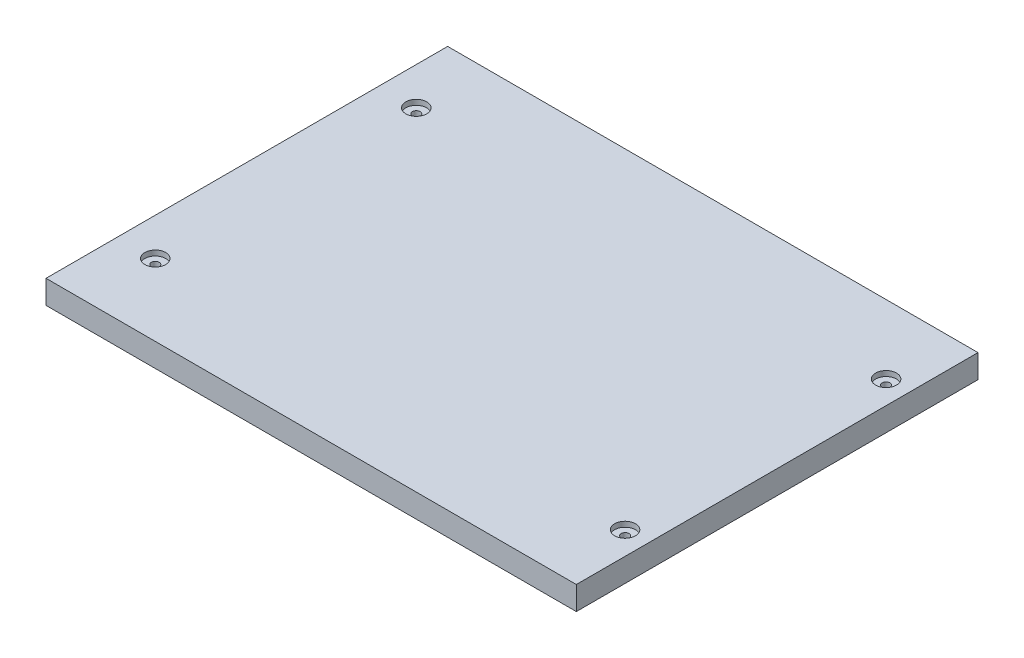
ISO-10303-21;
HEADER;
FILE_DESCRIPTION(('STEP AP214'),'2;1');
FILE_NAME('part.step','',(''),(''),'','','');
FILE_SCHEMA(('AUTOMOTIVE_DESIGN { 1 0 10303 214 1 1 1 1 }'));
ENDSEC;
DATA;
#1=APPLICATION_CONTEXT('core data for automotive mechanical design processes');
#2=APPLICATION_PROTOCOL_DEFINITION('international standard','automotive_design',2000,#1);
#3=PRODUCT_CONTEXT('',#1,'mechanical');
#4=PRODUCT('Part','Part','',(#3));
#5=PRODUCT_RELATED_PRODUCT_CATEGORY('part','',(#4));
#6=PRODUCT_DEFINITION_FORMATION('','',#4);
#7=PRODUCT_DEFINITION_CONTEXT('part definition',#1,'design');
#8=PRODUCT_DEFINITION('design','',#6,#7);
#9=PRODUCT_DEFINITION_SHAPE('','',#8);
#10=(LENGTH_UNIT() NAMED_UNIT(*) SI_UNIT(.MILLI.,.METRE.));
#11=(NAMED_UNIT(*) PLANE_ANGLE_UNIT() SI_UNIT($,.RADIAN.));
#12=(NAMED_UNIT(*) SI_UNIT($,.STERADIAN.) SOLID_ANGLE_UNIT());
#13=UNCERTAINTY_MEASURE_WITH_UNIT(LENGTH_MEASURE(1.E-05),#10,'distance_accuracy_value','');
#14=(GEOMETRIC_REPRESENTATION_CONTEXT(3) GLOBAL_UNCERTAINTY_ASSIGNED_CONTEXT((#13)) GLOBAL_UNIT_ASSIGNED_CONTEXT((#10,
#11,#12)) REPRESENTATION_CONTEXT('',''));
#15=CARTESIAN_POINT('',(0.,0.,0.));
#16=DIRECTION('',(0.,0.,1.));
#17=DIRECTION('',(1.,0.,0.));
#18=AXIS2_PLACEMENT_3D('',#15,#16,#17);
#19=CARTESIAN_POINT('',(0.,18.,0.));
#20=DIRECTION('',(1.,0.,0.));
#21=DIRECTION('',(0.,0.,-1.));
#22=AXIS2_PLACEMENT_3D('',#19,#20,#21);
#23=PLANE('',#22);
#24=DIRECTION('',(0.,0.,1.));
#25=VECTOR('',#24,1.);
#26=CARTESIAN_POINT('',(0.,0.,0.));
#27=LINE('',#26,#25);
#28=CARTESIAN_POINT('',(0.,0.,-307.8));
#29=VERTEX_POINT('',#28);
#30=CARTESIAN_POINT('',(0.,0.,0.));
#31=VERTEX_POINT('',#30);
#32=EDGE_CURVE('E116',#29,#31,#27,.T.);
#33=ORIENTED_EDGE('',*,*,#32,.T.);
#34=DIRECTION('',(0.,-1.,0.));
#35=VECTOR('',#34,1.);
#36=CARTESIAN_POINT('',(0.,18.,0.));
#37=LINE('',#36,#35);
#38=CARTESIAN_POINT('',(0.,18.,0.));
#39=VERTEX_POINT('',#38);
#40=EDGE_CURVE('E11',#39,#31,#37,.T.);
#41=ORIENTED_EDGE('',*,*,#40,.F.);
#42=DIRECTION('',(0.,0.,1.));
#43=VECTOR('',#42,1.);
#44=CARTESIAN_POINT('',(0.,18.,0.));
#45=LINE('',#44,#43);
#46=CARTESIAN_POINT('',(0.,18.,-307.8));
#47=VERTEX_POINT('',#46);
#48=EDGE_CURVE('E99',#47,#39,#45,.T.);
#49=ORIENTED_EDGE('',*,*,#48,.F.);
#50=DIRECTION('',(0.,-1.,0.));
#51=VECTOR('',#50,1.);
#52=CARTESIAN_POINT('',(0.,18.,-307.8));
#53=LINE('',#52,#51);
#54=EDGE_CURVE('E112',#47,#29,#53,.T.);
#55=ORIENTED_EDGE('',*,*,#54,.T.);
#56=EDGE_LOOP('',(#33,#41,#49,#55));
#57=FACE_BOUND('',#56,.T.);
#58=ADVANCED_FACE('F45',(#57),#23,.F.);
#59=CARTESIAN_POINT('',(0.,18.,0.));
#60=DIRECTION('',(0.,0.,-1.));
#61=DIRECTION('',(-1.,0.,0.));
#62=AXIS2_PLACEMENT_3D('',#59,#60,#61);
#63=PLANE('',#62);
#64=DIRECTION('',(1.,0.,0.));
#65=VECTOR('',#64,1.);
#66=CARTESIAN_POINT('',(0.,0.,0.));
#67=LINE('',#66,#65);
#68=CARTESIAN_POINT('',(406.4,0.,0.));
#69=VERTEX_POINT('',#68);
#70=EDGE_CURVE('E104',#31,#69,#67,.T.);
#71=ORIENTED_EDGE('',*,*,#70,.T.);
#72=DIRECTION('',(0.,-1.,0.));
#73=VECTOR('',#72,1.);
#74=CARTESIAN_POINT('',(406.4,18.,0.));
#75=LINE('',#74,#73);
#76=CARTESIAN_POINT('',(406.4,18.,0.));
#77=VERTEX_POINT('',#76);
#78=EDGE_CURVE('E55',#77,#69,#75,.T.);
#79=ORIENTED_EDGE('',*,*,#78,.F.);
#80=DIRECTION('',(1.,0.,0.));
#81=VECTOR('',#80,1.);
#82=CARTESIAN_POINT('',(0.,18.,0.));
#83=LINE('',#82,#81);
#84=EDGE_CURVE('E94',#39,#77,#83,.T.);
#85=ORIENTED_EDGE('',*,*,#84,.F.);
#86=ORIENTED_EDGE('',*,*,#40,.T.);
#87=EDGE_LOOP('',(#71,#79,#85,#86));
#88=FACE_BOUND('',#87,.T.);
#89=ADVANCED_FACE('F103',(#88),#63,.F.);
#90=CARTESIAN_POINT('',(406.4,18.,0.));
#91=DIRECTION('',(-1.,0.,0.));
#92=DIRECTION('',(0.,0.,1.));
#93=AXIS2_PLACEMENT_3D('',#90,#91,#92);
#94=PLANE('',#93);
#95=DIRECTION('',(0.,0.,-1.));
#96=VECTOR('',#95,1.);
#97=CARTESIAN_POINT('',(406.4,0.,0.));
#98=LINE('',#97,#96);
#99=CARTESIAN_POINT('',(406.4,0.,-307.8));
#100=VERTEX_POINT('',#99);
#101=EDGE_CURVE('E81',#69,#100,#98,.T.);
#102=ORIENTED_EDGE('',*,*,#101,.T.);
#103=DIRECTION('',(0.,-1.,0.));
#104=VECTOR('',#103,1.);
#105=CARTESIAN_POINT('',(406.4,18.,-307.8));
#106=LINE('',#105,#104);
#107=CARTESIAN_POINT('',(406.4,18.,-307.8));
#108=VERTEX_POINT('',#107);
#109=EDGE_CURVE('E106',#108,#100,#106,.T.);
#110=ORIENTED_EDGE('',*,*,#109,.F.);
#111=DIRECTION('',(0.,0.,-1.));
#112=VECTOR('',#111,1.);
#113=CARTESIAN_POINT('',(406.4,18.,0.));
#114=LINE('',#113,#112);
#115=EDGE_CURVE('E97',#77,#108,#114,.T.);
#116=ORIENTED_EDGE('',*,*,#115,.F.);
#117=ORIENTED_EDGE('',*,*,#78,.T.);
#118=EDGE_LOOP('',(#102,#110,#116,#117));
#119=FACE_BOUND('',#118,.T.);
#120=ADVANCED_FACE('F108',(#119),#94,.F.);
#121=CARTESIAN_POINT('',(0.,18.,-307.8));
#122=DIRECTION('',(0.,0.,1.));
#123=DIRECTION('',(1.,0.,0.));
#124=AXIS2_PLACEMENT_3D('',#121,#122,#123);
#125=PLANE('',#124);
#126=DIRECTION('',(-1.,0.,0.));
#127=VECTOR('',#126,1.);
#128=CARTESIAN_POINT('',(0.,0.,-307.8));
#129=LINE('',#128,#127);
#130=EDGE_CURVE('E87',#100,#29,#129,.T.);
#131=ORIENTED_EDGE('',*,*,#130,.T.);
#132=ORIENTED_EDGE('',*,*,#54,.F.);
#133=DIRECTION('',(-1.,0.,0.));
#134=VECTOR('',#133,1.);
#135=CARTESIAN_POINT('',(0.,18.,-307.8));
#136=LINE('',#135,#134);
#137=EDGE_CURVE('E64',#108,#47,#136,.T.);
#138=ORIENTED_EDGE('',*,*,#137,.F.);
#139=ORIENTED_EDGE('',*,*,#109,.T.);
#140=EDGE_LOOP('',(#131,#132,#138,#139));
#141=FACE_BOUND('',#140,.T.);
#142=ADVANCED_FACE('F232',(#141),#125,.F.);
#143=CARTESIAN_POINT('',(0.,18.,0.));
#144=DIRECTION('',(0.,-1.,0.));
#145=DIRECTION('',(0.,0.,-1.));
#146=AXIS2_PLACEMENT_3D('',#143,#144,#145);
#147=PLANE('',#146);
#148=CARTESIAN_POINT('',(28.7499999999999,18.,-255.));
#149=DIRECTION('',(0.,1.,0.));
#150=DIRECTION('',(0.,0.,1.));
#151=AXIS2_PLACEMENT_3D('',#148,#149,#150);
#152=CIRCLE('',#151,8.);
#153=CARTESIAN_POINT('',(28.7499999999999,18.,-247.));
#154=VERTEX_POINT('',#153);
#155=EDGE_CURVE('E151',#154,#154,#152,.T.);
#156=ORIENTED_EDGE('',*,*,#155,.F.);
#157=EDGE_LOOP('',(#156));
#158=FACE_BOUND('',#157,.T.);
#159=CARTESIAN_POINT('',(388.75,18.,-55.0000000000002));
#160=DIRECTION('',(0.,1.,0.));
#161=DIRECTION('',(0.,0.,1.));
#162=AXIS2_PLACEMENT_3D('',#159,#160,#161);
#163=CIRCLE('',#162,7.99999999999998);
#164=CARTESIAN_POINT('',(388.75,18.,-47.0000000000003));
#165=VERTEX_POINT('',#164);
#166=EDGE_CURVE('E176',#165,#165,#163,.T.);
#167=ORIENTED_EDGE('',*,*,#166,.F.);
#168=EDGE_LOOP('',(#167));
#169=FACE_BOUND('',#168,.T.);
#170=CARTESIAN_POINT('',(388.75,18.,-255.));
#171=DIRECTION('',(0.,1.,0.));
#172=DIRECTION('',(0.,0.,1.));
#173=AXIS2_PLACEMENT_3D('',#170,#171,#172);
#174=CIRCLE('',#173,7.99999999999999);
#175=CARTESIAN_POINT('',(388.75,18.,-247.));
#176=VERTEX_POINT('',#175);
#177=EDGE_CURVE('E167',#176,#176,#174,.T.);
#178=ORIENTED_EDGE('',*,*,#177,.F.);
#179=EDGE_LOOP('',(#178));
#180=FACE_BOUND('',#179,.T.);
#181=CARTESIAN_POINT('',(28.75,18.,-55.));
#182=DIRECTION('',(0.,1.,0.));
#183=DIRECTION('',(0.,0.,1.));
#184=AXIS2_PLACEMENT_3D('',#181,#182,#183);
#185=CIRCLE('',#184,8.);
#186=CARTESIAN_POINT('',(28.75,18.,-47.));
#187=VERTEX_POINT('',#186);
#188=EDGE_CURVE('E164',#187,#187,#185,.T.);
#189=ORIENTED_EDGE('',*,*,#188,.F.);
#190=EDGE_LOOP('',(#189));
#191=FACE_BOUND('',#190,.T.);
#192=ORIENTED_EDGE('',*,*,#48,.T.);
#193=ORIENTED_EDGE('',*,*,#84,.T.);
#194=ORIENTED_EDGE('',*,*,#115,.T.);
#195=ORIENTED_EDGE('',*,*,#137,.T.);
#196=EDGE_LOOP('',(#192,#193,#194,#195));
#197=FACE_BOUND('',#196,.T.);
#198=ADVANCED_FACE('F95',(#158,#169,#180,#191,#197),#147,.F.);
#199=CARTESIAN_POINT('',(0.,0.,0.));
#200=DIRECTION('',(0.,-1.,0.));
#201=DIRECTION('',(0.,0.,-1.));
#202=AXIS2_PLACEMENT_3D('',#199,#200,#201);
#203=PLANE('',#202);
#204=CARTESIAN_POINT('',(388.75,0.,-255.));
#205=DIRECTION('',(0.,1.,0.));
#206=DIRECTION('',(0.,0.,1.));
#207=AXIS2_PLACEMENT_3D('',#204,#205,#206);
#208=CIRCLE('',#207,2.99999999999999);
#209=CARTESIAN_POINT('',(388.75,0.,-252.));
#210=VERTEX_POINT('',#209);
#211=EDGE_CURVE('E189',#210,#210,#208,.T.);
#212=ORIENTED_EDGE('',*,*,#211,.T.);
#213=EDGE_LOOP('',(#212));
#214=FACE_BOUND('',#213,.T.);
#215=CARTESIAN_POINT('',(388.75,0.,-55.0000000000002));
#216=DIRECTION('',(0.,1.,0.));
#217=DIRECTION('',(0.,0.,1.));
#218=AXIS2_PLACEMENT_3D('',#215,#216,#217);
#219=CIRCLE('',#218,2.99999999999999);
#220=CARTESIAN_POINT('',(388.75,0.,-52.0000000000002));
#221=VERTEX_POINT('',#220);
#222=EDGE_CURVE('E193',#221,#221,#219,.T.);
#223=ORIENTED_EDGE('',*,*,#222,.T.);
#224=EDGE_LOOP('',(#223));
#225=FACE_BOUND('',#224,.T.);
#226=CARTESIAN_POINT('',(28.75,0.,-55.));
#227=DIRECTION('',(0.,1.,0.));
#228=DIRECTION('',(0.,0.,1.));
#229=AXIS2_PLACEMENT_3D('',#226,#227,#228);
#230=CIRCLE('',#229,3.);
#231=CARTESIAN_POINT('',(28.75,0.,-52.));
#232=VERTEX_POINT('',#231);
#233=EDGE_CURVE('E188',#232,#232,#230,.T.);
#234=ORIENTED_EDGE('',*,*,#233,.T.);
#235=EDGE_LOOP('',(#234));
#236=FACE_BOUND('',#235,.T.);
#237=CARTESIAN_POINT('',(28.7499999999999,0.,-255.));
#238=DIRECTION('',(0.,1.,0.));
#239=DIRECTION('',(0.,0.,1.));
#240=AXIS2_PLACEMENT_3D('',#237,#238,#239);
#241=CIRCLE('',#240,3.);
#242=CARTESIAN_POINT('',(28.7499999999999,0.,-252.));
#243=VERTEX_POINT('',#242);
#244=EDGE_CURVE('E136',#243,#243,#241,.T.);
#245=ORIENTED_EDGE('',*,*,#244,.T.);
#246=EDGE_LOOP('',(#245));
#247=FACE_BOUND('',#246,.T.);
#248=ORIENTED_EDGE('',*,*,#32,.F.);
#249=ORIENTED_EDGE('',*,*,#130,.F.);
#250=ORIENTED_EDGE('',*,*,#101,.F.);
#251=ORIENTED_EDGE('',*,*,#70,.F.);
#252=EDGE_LOOP('',(#248,#249,#250,#251));
#253=FACE_BOUND('',#252,.T.);
#254=ADVANCED_FACE('F201',(#214,#225,#236,#247,#253),#203,.T.);
#255=CARTESIAN_POINT('',(28.75,14.,-55.));
#256=DIRECTION('',(0.,1.,0.));
#257=DIRECTION('',(0.,0.,1.));
#258=AXIS2_PLACEMENT_3D('',#255,#256,#257);
#259=CYLINDRICAL_SURFACE('',#258,8.);
#260=CARTESIAN_POINT('',(28.75,14.,-55.));
#261=DIRECTION('',(0.,1.,0.));
#262=DIRECTION('',(0.,0.,1.));
#263=AXIS2_PLACEMENT_3D('',#260,#261,#262);
#264=CIRCLE('',#263,8.);
#265=CARTESIAN_POINT('',(28.75,14.,-47.));
#266=VERTEX_POINT('',#265);
#267=EDGE_CURVE('E120',#266,#266,#264,.T.);
#268=ORIENTED_EDGE('',*,*,#267,.F.);
#269=EDGE_LOOP('',(#268));
#270=FACE_BOUND('',#269,.T.);
#271=ORIENTED_EDGE('',*,*,#188,.T.);
#272=EDGE_LOOP('',(#271));
#273=FACE_BOUND('',#272,.T.);
#274=ADVANCED_FACE('F222',(#270,#273),#259,.F.);
#275=CARTESIAN_POINT('',(28.75,14.,-55.));
#276=DIRECTION('',(0.,1.,0.));
#277=DIRECTION('',(0.,0.,1.));
#278=AXIS2_PLACEMENT_3D('',#275,#276,#277);
#279=PLANE('',#278);
#280=CARTESIAN_POINT('',(28.75,14.,-55.));
#281=DIRECTION('',(0.,1.,0.));
#282=DIRECTION('',(0.,0.,1.));
#283=AXIS2_PLACEMENT_3D('',#280,#281,#282);
#284=CIRCLE('',#283,3.);
#285=CARTESIAN_POINT('',(28.75,14.,-52.));
#286=VERTEX_POINT('',#285);
#287=EDGE_CURVE('E48',#286,#286,#284,.T.);
#288=ORIENTED_EDGE('',*,*,#287,.F.);
#289=EDGE_LOOP('',(#288));
#290=FACE_BOUND('',#289,.T.);
#291=ORIENTED_EDGE('',*,*,#267,.T.);
#292=EDGE_LOOP('',(#291));
#293=FACE_BOUND('',#292,.T.);
#294=ADVANCED_FACE('F229',(#290,#293),#279,.T.);
#295=CARTESIAN_POINT('',(388.75,14.,-255.));
#296=DIRECTION('',(0.,1.,0.));
#297=DIRECTION('',(0.,0.,1.));
#298=AXIS2_PLACEMENT_3D('',#295,#296,#297);
#299=CYLINDRICAL_SURFACE('',#298,7.99999999999999);
#300=CARTESIAN_POINT('',(388.75,14.,-255.));
#301=DIRECTION('',(0.,1.,0.));
#302=DIRECTION('',(0.,0.,1.));
#303=AXIS2_PLACEMENT_3D('',#300,#301,#302);
#304=CIRCLE('',#303,7.99999999999999);
#305=CARTESIAN_POINT('',(388.75,14.,-247.));
#306=VERTEX_POINT('',#305);
#307=EDGE_CURVE('E172',#306,#306,#304,.T.);
#308=ORIENTED_EDGE('',*,*,#307,.F.);
#309=EDGE_LOOP('',(#308));
#310=FACE_BOUND('',#309,.T.);
#311=ORIENTED_EDGE('',*,*,#177,.T.);
#312=EDGE_LOOP('',(#311));
#313=FACE_BOUND('',#312,.T.);
#314=ADVANCED_FACE('F268',(#310,#313),#299,.F.);
#315=CARTESIAN_POINT('',(388.75,14.,-255.));
#316=DIRECTION('',(0.,1.,0.));
#317=DIRECTION('',(0.,0.,1.));
#318=AXIS2_PLACEMENT_3D('',#315,#316,#317);
#319=PLANE('',#318);
#320=CARTESIAN_POINT('',(388.75,14.,-255.));
#321=DIRECTION('',(0.,1.,0.));
#322=DIRECTION('',(0.,0.,1.));
#323=AXIS2_PLACEMENT_3D('',#320,#321,#322);
#324=CIRCLE('',#323,2.99999999999999);
#325=CARTESIAN_POINT('',(388.75,14.,-252.));
#326=VERTEX_POINT('',#325);
#327=EDGE_CURVE('E139',#326,#326,#324,.T.);
#328=ORIENTED_EDGE('',*,*,#327,.F.);
#329=EDGE_LOOP('',(#328));
#330=FACE_BOUND('',#329,.T.);
#331=ORIENTED_EDGE('',*,*,#307,.T.);
#332=EDGE_LOOP('',(#331));
#333=FACE_BOUND('',#332,.T.);
#334=ADVANCED_FACE('F273',(#330,#333),#319,.T.);
#335=CARTESIAN_POINT('',(388.75,14.,-55.0000000000002));
#336=DIRECTION('',(0.,1.,0.));
#337=DIRECTION('',(0.,0.,1.));
#338=AXIS2_PLACEMENT_3D('',#335,#336,#337);
#339=CYLINDRICAL_SURFACE('',#338,7.99999999999998);
#340=CARTESIAN_POINT('',(388.75,14.,-55.0000000000002));
#341=DIRECTION('',(0.,1.,0.));
#342=DIRECTION('',(0.,0.,1.));
#343=AXIS2_PLACEMENT_3D('',#340,#341,#342);
#344=CIRCLE('',#343,7.99999999999998);
#345=CARTESIAN_POINT('',(388.75,14.,-47.0000000000003));
#346=VERTEX_POINT('',#345);
#347=EDGE_CURVE('E157',#346,#346,#344,.T.);
#348=ORIENTED_EDGE('',*,*,#347,.F.);
#349=EDGE_LOOP('',(#348));
#350=FACE_BOUND('',#349,.T.);
#351=ORIENTED_EDGE('',*,*,#166,.T.);
#352=EDGE_LOOP('',(#351));
#353=FACE_BOUND('',#352,.T.);
#354=ADVANCED_FACE('F282',(#350,#353),#339,.F.);
#355=CARTESIAN_POINT('',(388.75,14.,-55.0000000000002));
#356=DIRECTION('',(0.,1.,0.));
#357=DIRECTION('',(0.,0.,1.));
#358=AXIS2_PLACEMENT_3D('',#355,#356,#357);
#359=PLANE('',#358);
#360=CARTESIAN_POINT('',(388.75,14.,-55.0000000000002));
#361=DIRECTION('',(0.,1.,0.));
#362=DIRECTION('',(0.,0.,1.));
#363=AXIS2_PLACEMENT_3D('',#360,#361,#362);
#364=CIRCLE('',#363,2.99999999999999);
#365=CARTESIAN_POINT('',(388.75,14.,-52.0000000000002));
#366=VERTEX_POINT('',#365);
#367=EDGE_CURVE('E135',#366,#366,#364,.T.);
#368=ORIENTED_EDGE('',*,*,#367,.F.);
#369=EDGE_LOOP('',(#368));
#370=FACE_BOUND('',#369,.T.);
#371=ORIENTED_EDGE('',*,*,#347,.T.);
#372=EDGE_LOOP('',(#371));
#373=FACE_BOUND('',#372,.T.);
#374=ADVANCED_FACE('F287',(#370,#373),#359,.T.);
#375=CARTESIAN_POINT('',(28.7499999999999,14.,-255.));
#376=DIRECTION('',(0.,1.,0.));
#377=DIRECTION('',(0.,0.,1.));
#378=AXIS2_PLACEMENT_3D('',#375,#376,#377);
#379=CYLINDRICAL_SURFACE('',#378,8.);
#380=CARTESIAN_POINT('',(28.7499999999999,14.,-255.));
#381=DIRECTION('',(0.,1.,0.));
#382=DIRECTION('',(0.,0.,1.));
#383=AXIS2_PLACEMENT_3D('',#380,#381,#382);
#384=CIRCLE('',#383,8.);
#385=CARTESIAN_POINT('',(28.7499999999999,14.,-247.));
#386=VERTEX_POINT('',#385);
#387=EDGE_CURVE('E146',#386,#386,#384,.T.);
#388=ORIENTED_EDGE('',*,*,#387,.F.);
#389=EDGE_LOOP('',(#388));
#390=FACE_BOUND('',#389,.T.);
#391=ORIENTED_EDGE('',*,*,#155,.T.);
#392=EDGE_LOOP('',(#391));
#393=FACE_BOUND('',#392,.T.);
#394=ADVANCED_FACE('F296',(#390,#393),#379,.F.);
#395=CARTESIAN_POINT('',(28.7499999999999,14.,-255.));
#396=DIRECTION('',(0.,1.,0.));
#397=DIRECTION('',(0.,0.,1.));
#398=AXIS2_PLACEMENT_3D('',#395,#396,#397);
#399=PLANE('',#398);
#400=CARTESIAN_POINT('',(28.7499999999999,14.,-255.));
#401=DIRECTION('',(0.,1.,0.));
#402=DIRECTION('',(0.,0.,1.));
#403=AXIS2_PLACEMENT_3D('',#400,#401,#402);
#404=CIRCLE('',#403,3.);
#405=CARTESIAN_POINT('',(28.7499999999999,14.,-252.));
#406=VERTEX_POINT('',#405);
#407=EDGE_CURVE('E131',#406,#406,#404,.T.);
#408=ORIENTED_EDGE('',*,*,#407,.F.);
#409=EDGE_LOOP('',(#408));
#410=FACE_BOUND('',#409,.T.);
#411=ORIENTED_EDGE('',*,*,#387,.T.);
#412=EDGE_LOOP('',(#411));
#413=FACE_BOUND('',#412,.T.);
#414=ADVANCED_FACE('F300',(#410,#413),#399,.T.);
#415=CARTESIAN_POINT('',(28.7499999999999,0.,-255.));
#416=DIRECTION('',(0.,1.,0.));
#417=DIRECTION('',(0.,0.,1.));
#418=AXIS2_PLACEMENT_3D('',#415,#416,#417);
#419=CYLINDRICAL_SURFACE('',#418,3.);
#420=ORIENTED_EDGE('',*,*,#407,.T.);
#421=EDGE_LOOP('',(#420));
#422=FACE_BOUND('',#421,.T.);
#423=ORIENTED_EDGE('',*,*,#244,.F.);
#424=EDGE_LOOP('',(#423));
#425=FACE_BOUND('',#424,.T.);
#426=ADVANCED_FACE('F340',(#422,#425),#419,.F.);
#427=CARTESIAN_POINT('',(388.75,0.,-55.0000000000002));
#428=DIRECTION('',(0.,1.,0.));
#429=DIRECTION('',(0.,0.,1.));
#430=AXIS2_PLACEMENT_3D('',#427,#428,#429);
#431=CYLINDRICAL_SURFACE('',#430,2.99999999999999);
#432=ORIENTED_EDGE('',*,*,#367,.T.);
#433=EDGE_LOOP('',(#432));
#434=FACE_BOUND('',#433,.T.);
#435=ORIENTED_EDGE('',*,*,#222,.F.);
#436=EDGE_LOOP('',(#435));
#437=FACE_BOUND('',#436,.T.);
#438=ADVANCED_FACE('F211',(#434,#437),#431,.F.);
#439=CARTESIAN_POINT('',(388.75,0.,-255.));
#440=DIRECTION('',(0.,1.,0.));
#441=DIRECTION('',(0.,0.,1.));
#442=AXIS2_PLACEMENT_3D('',#439,#440,#441);
#443=CYLINDRICAL_SURFACE('',#442,2.99999999999999);
#444=ORIENTED_EDGE('',*,*,#327,.T.);
#445=EDGE_LOOP('',(#444));
#446=FACE_BOUND('',#445,.T.);
#447=ORIENTED_EDGE('',*,*,#211,.F.);
#448=EDGE_LOOP('',(#447));
#449=FACE_BOUND('',#448,.T.);
#450=ADVANCED_FACE('F206',(#446,#449),#443,.F.);
#451=CARTESIAN_POINT('',(28.75,0.,-55.));
#452=DIRECTION('',(0.,1.,0.));
#453=DIRECTION('',(0.,0.,1.));
#454=AXIS2_PLACEMENT_3D('',#451,#452,#453);
#455=CYLINDRICAL_SURFACE('',#454,3.);
#456=ORIENTED_EDGE('',*,*,#287,.T.);
#457=EDGE_LOOP('',(#456));
#458=FACE_BOUND('',#457,.T.);
#459=ORIENTED_EDGE('',*,*,#233,.F.);
#460=EDGE_LOOP('',(#459));
#461=FACE_BOUND('',#460,.T.);
#462=ADVANCED_FACE('F204',(#458,#461),#455,.F.);
#463=CLOSED_SHELL('',(#58,#89,#120,#142,#198,#254,#274,#294,#314,#334,#354,#374,#394,#414,#426,
#438,#450,#462));
#464=MANIFOLD_SOLID_BREP('B2',#463);
#465=ADVANCED_BREP_SHAPE_REPRESENTATION('',(#18,#464),#14);
#466=SHAPE_DEFINITION_REPRESENTATION(#9,#465);
ENDSEC;
END-ISO-10303-21;
